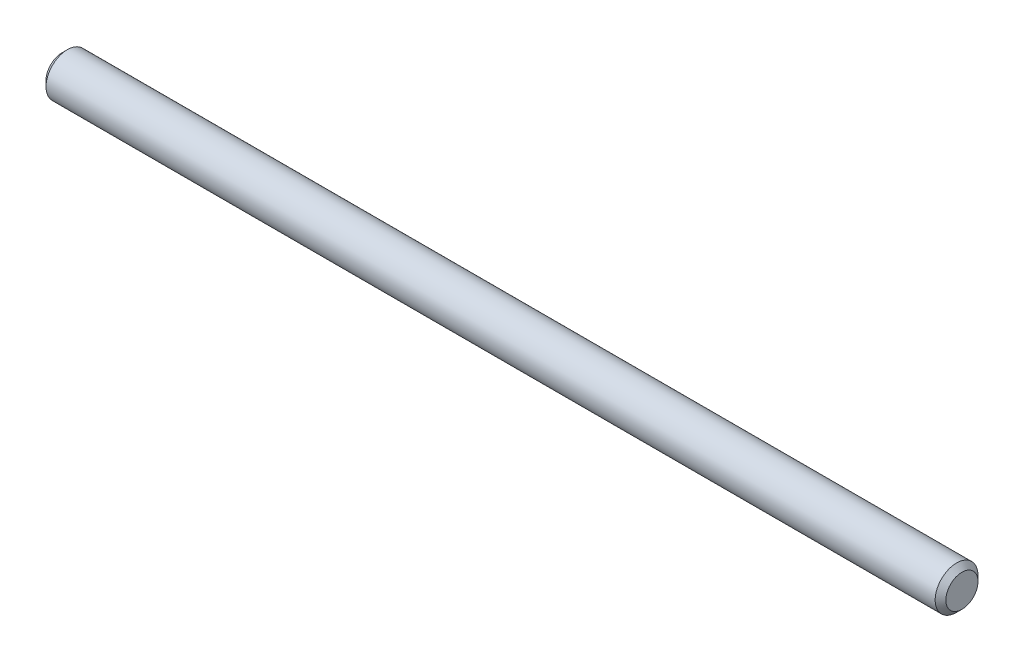
ISO-10303-21;
HEADER;
FILE_DESCRIPTION(('STEP AP214'),'2;1');
FILE_NAME('part.step','',(''),(''),'','','');
FILE_SCHEMA(('AUTOMOTIVE_DESIGN { 1 0 10303 214 1 1 1 1 }'));
ENDSEC;
DATA;
#1=APPLICATION_CONTEXT('core data for automotive mechanical design processes');
#2=APPLICATION_PROTOCOL_DEFINITION('international standard','automotive_design',2000,#1);
#3=PRODUCT_CONTEXT('',#1,'mechanical');
#4=PRODUCT('Part','Part','',(#3));
#5=PRODUCT_RELATED_PRODUCT_CATEGORY('part','',(#4));
#6=PRODUCT_DEFINITION_FORMATION('','',#4);
#7=PRODUCT_DEFINITION_CONTEXT('part definition',#1,'design');
#8=PRODUCT_DEFINITION('design','',#6,#7);
#9=PRODUCT_DEFINITION_SHAPE('','',#8);
#10=(LENGTH_UNIT() NAMED_UNIT(*) SI_UNIT(.MILLI.,.METRE.));
#11=(NAMED_UNIT(*) PLANE_ANGLE_UNIT() SI_UNIT($,.RADIAN.));
#12=(NAMED_UNIT(*) SI_UNIT($,.STERADIAN.) SOLID_ANGLE_UNIT());
#13=UNCERTAINTY_MEASURE_WITH_UNIT(LENGTH_MEASURE(1.E-05),#10,'distance_accuracy_value','');
#14=(GEOMETRIC_REPRESENTATION_CONTEXT(3) GLOBAL_UNCERTAINTY_ASSIGNED_CONTEXT((#13)) GLOBAL_UNIT_ASSIGNED_CONTEXT((#10,
#11,#12)) REPRESENTATION_CONTEXT('',''));
#15=CARTESIAN_POINT('',(0.,0.,0.));
#16=DIRECTION('',(0.,0.,1.));
#17=DIRECTION('',(1.,0.,0.));
#18=AXIS2_PLACEMENT_3D('',#15,#16,#17);
#19=CARTESIAN_POINT('',(84.,0.,0.));
#20=DIRECTION('',(-1.,0.,0.));
#21=DIRECTION('',(0.,0.,1.));
#22=AXIS2_PLACEMENT_3D('',#19,#20,#21);
#23=CYLINDRICAL_SURFACE('',#22,2.);
#24=CARTESIAN_POINT('',(83.5,0.,0.));
#25=DIRECTION('',(1.,0.,0.));
#26=DIRECTION('',(0.,0.,-1.));
#27=AXIS2_PLACEMENT_3D('',#24,#25,#26);
#28=CIRCLE('',#27,2.);
#29=CARTESIAN_POINT('',(83.5,0.,-2.));
#30=VERTEX_POINT('',#29);
#31=EDGE_CURVE('E10',#30,#30,#28,.F.);
#32=ORIENTED_EDGE('',*,*,#31,.T.);
#33=EDGE_LOOP('',(#32));
#34=FACE_BOUND('',#33,.T.);
#35=CARTESIAN_POINT('',(0.500000000000042,0.,0.));
#36=DIRECTION('',(1.,0.,0.));
#37=DIRECTION('',(0.,0.,-1.));
#38=AXIS2_PLACEMENT_3D('',#35,#36,#37);
#39=CIRCLE('',#38,2.);
#40=CARTESIAN_POINT('',(0.500000000000042,0.,-2.));
#41=VERTEX_POINT('',#40);
#42=EDGE_CURVE('E66',#41,#41,#39,.T.);
#43=ORIENTED_EDGE('',*,*,#42,.T.);
#44=EDGE_LOOP('',(#43));
#45=FACE_BOUND('',#44,.T.);
#46=ADVANCED_FACE('F47',(#34,#45),#23,.T.);
#47=CARTESIAN_POINT('',(84.,0.,0.));
#48=DIRECTION('',(1.,0.,0.));
#49=DIRECTION('',(0.,0.,-1.));
#50=AXIS2_PLACEMENT_3D('',#47,#48,#49);
#51=PLANE('',#50);
#52=CARTESIAN_POINT('',(84.,0.,0.));
#53=DIRECTION('',(1.,0.,0.));
#54=DIRECTION('',(0.,0.,-1.));
#55=AXIS2_PLACEMENT_3D('',#52,#53,#54);
#56=CIRCLE('',#55,1.50000000000003);
#57=CARTESIAN_POINT('',(84.,0.,-1.50000000000003));
#58=VERTEX_POINT('',#57);
#59=EDGE_CURVE('E56',#58,#58,#56,.T.);
#60=ORIENTED_EDGE('',*,*,#59,.T.);
#61=EDGE_LOOP('',(#60));
#62=FACE_BOUND('',#61,.T.);
#63=ADVANCED_FACE('F83',(#62),#51,.T.);
#64=CARTESIAN_POINT('',(0.,0.,0.));
#65=DIRECTION('',(1.,0.,0.));
#66=DIRECTION('',(0.,0.,-1.));
#67=AXIS2_PLACEMENT_3D('',#64,#65,#66);
#68=PLANE('',#67);
#69=CARTESIAN_POINT('',(0.,0.,0.));
#70=DIRECTION('',(1.,0.,0.));
#71=DIRECTION('',(0.,0.,-1.));
#72=AXIS2_PLACEMENT_3D('',#69,#70,#71);
#73=CIRCLE('',#72,1.49999999999995);
#74=CARTESIAN_POINT('',(0.,0.,-1.49999999999995));
#75=VERTEX_POINT('',#74);
#76=EDGE_CURVE('E61',#75,#75,#73,.F.);
#77=ORIENTED_EDGE('',*,*,#76,.T.);
#78=EDGE_LOOP('',(#77));
#79=FACE_BOUND('',#78,.T.);
#80=ADVANCED_FACE('F76',(#79),#68,.F.);
#81=CARTESIAN_POINT('',(0.500000000000042,0.,0.));
#82=DIRECTION('',(1.,0.,0.));
#83=DIRECTION('',(0.,0.,-1.));
#84=AXIS2_PLACEMENT_3D('',#81,#82,#83);
#85=CONICAL_SURFACE('',#84,2.,0.785398163397454);
#86=ORIENTED_EDGE('',*,*,#76,.F.);
#87=EDGE_LOOP('',(#86));
#88=FACE_BOUND('',#87,.T.);
#89=ORIENTED_EDGE('',*,*,#42,.F.);
#90=EDGE_LOOP('',(#89));
#91=FACE_BOUND('',#90,.T.);
#92=ADVANCED_FACE('F74',(#88,#91),#85,.T.);
#93=CARTESIAN_POINT('',(84.,0.,0.));
#94=DIRECTION('',(-1.,0.,0.));
#95=DIRECTION('',(0.,0.,1.));
#96=AXIS2_PLACEMENT_3D('',#93,#94,#95);
#97=CONICAL_SURFACE('',#96,1.50000000000003,0.785398163397461);
#98=ORIENTED_EDGE('',*,*,#31,.F.);
#99=EDGE_LOOP('',(#98));
#100=FACE_BOUND('',#99,.T.);
#101=ORIENTED_EDGE('',*,*,#59,.F.);
#102=EDGE_LOOP('',(#101));
#103=FACE_BOUND('',#102,.T.);
#104=ADVANCED_FACE('F50',(#100,#103),#97,.T.);
#105=CLOSED_SHELL('',(#46,#63,#80,#92,#104));
#106=MANIFOLD_SOLID_BREP('B2',#105);
#107=ADVANCED_BREP_SHAPE_REPRESENTATION('',(#18,#106),#14);
#108=SHAPE_DEFINITION_REPRESENTATION(#9,#107);
ENDSEC;
END-ISO-10303-21;
